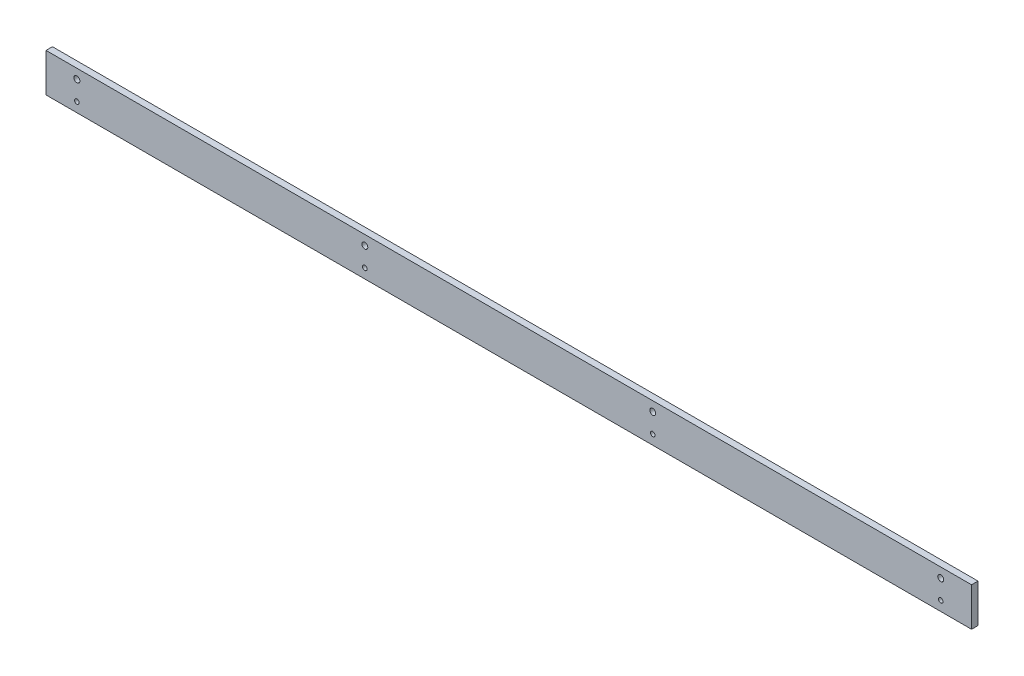
ISO-10303-21;
HEADER;
FILE_DESCRIPTION(('STEP AP214'),'2;1');
FILE_NAME('part.step','',(''),(''),'','','');
FILE_SCHEMA(('AUTOMOTIVE_DESIGN { 1 0 10303 214 1 1 1 1 }'));
ENDSEC;
DATA;
#1=APPLICATION_CONTEXT('core data for automotive mechanical design processes');
#2=APPLICATION_PROTOCOL_DEFINITION('international standard','automotive_design',2000,#1);
#3=PRODUCT_CONTEXT('',#1,'mechanical');
#4=PRODUCT('Part','Part','',(#3));
#5=PRODUCT_RELATED_PRODUCT_CATEGORY('part','',(#4));
#6=PRODUCT_DEFINITION_FORMATION('','',#4);
#7=PRODUCT_DEFINITION_CONTEXT('part definition',#1,'design');
#8=PRODUCT_DEFINITION('design','',#6,#7);
#9=PRODUCT_DEFINITION_SHAPE('','',#8);
#10=(LENGTH_UNIT() NAMED_UNIT(*) SI_UNIT(.MILLI.,.METRE.));
#11=(NAMED_UNIT(*) PLANE_ANGLE_UNIT() SI_UNIT($,.RADIAN.));
#12=(NAMED_UNIT(*) SI_UNIT($,.STERADIAN.) SOLID_ANGLE_UNIT());
#13=UNCERTAINTY_MEASURE_WITH_UNIT(LENGTH_MEASURE(1.E-05),#10,'distance_accuracy_value','');
#14=(GEOMETRIC_REPRESENTATION_CONTEXT(3) GLOBAL_UNCERTAINTY_ASSIGNED_CONTEXT((#13)) GLOBAL_UNIT_ASSIGNED_CONTEXT((#10,
#11,#12)) REPRESENTATION_CONTEXT('',''));
#15=CARTESIAN_POINT('',(0.,0.,0.));
#16=DIRECTION('',(0.,0.,1.));
#17=DIRECTION('',(1.,0.,0.));
#18=AXIS2_PLACEMENT_3D('',#15,#16,#17);
#19=CARTESIAN_POINT('',(-228.6,9.525,3.175));
#20=DIRECTION('',(1.,0.,0.));
#21=DIRECTION('',(0.,0.,-1.));
#22=AXIS2_PLACEMENT_3D('',#19,#20,#21);
#23=PLANE('',#22);
#24=DIRECTION('',(0.,-1.,0.));
#25=VECTOR('',#24,1.);
#26=CARTESIAN_POINT('',(-228.6,9.525,0.));
#27=LINE('',#26,#25);
#28=CARTESIAN_POINT('',(-228.6,9.525,0.));
#29=VERTEX_POINT('',#28);
#30=CARTESIAN_POINT('',(-228.6,-9.525,0.));
#31=VERTEX_POINT('',#30);
#32=EDGE_CURVE('E110',#29,#31,#27,.T.);
#33=ORIENTED_EDGE('',*,*,#32,.T.);
#34=DIRECTION('',(0.,0.,-1.));
#35=VECTOR('',#34,1.);
#36=CARTESIAN_POINT('',(-228.6,-9.525,3.175));
#37=LINE('',#36,#35);
#38=CARTESIAN_POINT('',(-228.6,-9.525,3.175));
#39=VERTEX_POINT('',#38);
#40=EDGE_CURVE('E13',#39,#31,#37,.T.);
#41=ORIENTED_EDGE('',*,*,#40,.F.);
#42=DIRECTION('',(0.,-1.,0.));
#43=VECTOR('',#42,1.);
#44=CARTESIAN_POINT('',(-228.6,9.525,3.175));
#45=LINE('',#44,#43);
#46=CARTESIAN_POINT('',(-228.6,9.525,3.175));
#47=VERTEX_POINT('',#46);
#48=EDGE_CURVE('E98',#47,#39,#45,.T.);
#49=ORIENTED_EDGE('',*,*,#48,.F.);
#50=DIRECTION('',(0.,0.,-1.));
#51=VECTOR('',#50,1.);
#52=CARTESIAN_POINT('',(-228.6,9.525,3.175));
#53=LINE('',#52,#51);
#54=EDGE_CURVE('E106',#47,#29,#53,.T.);
#55=ORIENTED_EDGE('',*,*,#54,.T.);
#56=EDGE_LOOP('',(#33,#41,#49,#55));
#57=FACE_BOUND('',#56,.T.);
#58=ADVANCED_FACE('F47',(#57),#23,.F.);
#59=CARTESIAN_POINT('',(228.6,-9.525,3.175));
#60=DIRECTION('',(0.,1.,0.));
#61=DIRECTION('',(0.,0.,1.));
#62=AXIS2_PLACEMENT_3D('',#59,#60,#61);
#63=PLANE('',#62);
#64=DIRECTION('',(1.,0.,0.));
#65=VECTOR('',#64,1.);
#66=CARTESIAN_POINT('',(228.6,-9.525,0.));
#67=LINE('',#66,#65);
#68=CARTESIAN_POINT('',(228.6,-9.525,0.));
#69=VERTEX_POINT('',#68);
#70=EDGE_CURVE('E102',#31,#69,#67,.T.);
#71=ORIENTED_EDGE('',*,*,#70,.T.);
#72=DIRECTION('',(0.,0.,-1.));
#73=VECTOR('',#72,1.);
#74=CARTESIAN_POINT('',(228.6,-9.525,3.175));
#75=LINE('',#74,#73);
#76=CARTESIAN_POINT('',(228.6,-9.525,3.175));
#77=VERTEX_POINT('',#76);
#78=EDGE_CURVE('E55',#77,#69,#75,.T.);
#79=ORIENTED_EDGE('',*,*,#78,.F.);
#80=DIRECTION('',(1.,0.,0.));
#81=VECTOR('',#80,1.);
#82=CARTESIAN_POINT('',(228.6,-9.525,3.175));
#83=LINE('',#82,#81);
#84=EDGE_CURVE('E93',#39,#77,#83,.T.);
#85=ORIENTED_EDGE('',*,*,#84,.F.);
#86=ORIENTED_EDGE('',*,*,#40,.T.);
#87=EDGE_LOOP('',(#71,#79,#85,#86));
#88=FACE_BOUND('',#87,.T.);
#89=ADVANCED_FACE('F101',(#88),#63,.F.);
#90=CARTESIAN_POINT('',(228.6,9.525,3.175));
#91=DIRECTION('',(-1.,0.,0.));
#92=DIRECTION('',(0.,0.,1.));
#93=AXIS2_PLACEMENT_3D('',#90,#91,#92);
#94=PLANE('',#93);
#95=DIRECTION('',(0.,1.,0.));
#96=VECTOR('',#95,1.);
#97=CARTESIAN_POINT('',(228.6,9.525,0.));
#98=LINE('',#97,#96);
#99=CARTESIAN_POINT('',(228.6,9.525,0.));
#100=VERTEX_POINT('',#99);
#101=EDGE_CURVE('E80',#69,#100,#98,.T.);
#102=ORIENTED_EDGE('',*,*,#101,.T.);
#103=DIRECTION('',(0.,0.,-1.));
#104=VECTOR('',#103,1.);
#105=CARTESIAN_POINT('',(228.6,9.525,3.175));
#106=LINE('',#105,#104);
#107=CARTESIAN_POINT('',(228.6,9.525,3.175));
#108=VERTEX_POINT('',#107);
#109=EDGE_CURVE('E103',#108,#100,#106,.T.);
#110=ORIENTED_EDGE('',*,*,#109,.F.);
#111=DIRECTION('',(0.,1.,0.));
#112=VECTOR('',#111,1.);
#113=CARTESIAN_POINT('',(228.6,9.525,3.175));
#114=LINE('',#113,#112);
#115=EDGE_CURVE('E96',#77,#108,#114,.T.);
#116=ORIENTED_EDGE('',*,*,#115,.F.);
#117=ORIENTED_EDGE('',*,*,#78,.T.);
#118=EDGE_LOOP('',(#102,#110,#116,#117));
#119=FACE_BOUND('',#118,.T.);
#120=ADVANCED_FACE('F104',(#119),#94,.F.);
#121=CARTESIAN_POINT('',(228.6,9.525,3.175));
#122=DIRECTION('',(0.,-1.,0.));
#123=DIRECTION('',(0.,0.,-1.));
#124=AXIS2_PLACEMENT_3D('',#121,#122,#123);
#125=PLANE('',#124);
#126=DIRECTION('',(-1.,0.,0.));
#127=VECTOR('',#126,1.);
#128=CARTESIAN_POINT('',(228.6,9.525,0.));
#129=LINE('',#128,#127);
#130=EDGE_CURVE('E86',#100,#29,#129,.T.);
#131=ORIENTED_EDGE('',*,*,#130,.T.);
#132=ORIENTED_EDGE('',*,*,#54,.F.);
#133=DIRECTION('',(-1.,0.,0.));
#134=VECTOR('',#133,1.);
#135=CARTESIAN_POINT('',(228.6,9.525,3.175));
#136=LINE('',#135,#134);
#137=EDGE_CURVE('E63',#108,#47,#136,.T.);
#138=ORIENTED_EDGE('',*,*,#137,.F.);
#139=ORIENTED_EDGE('',*,*,#109,.T.);
#140=EDGE_LOOP('',(#131,#132,#138,#139));
#141=FACE_BOUND('',#140,.T.);
#142=ADVANCED_FACE('F118',(#141),#125,.F.);
#143=CARTESIAN_POINT('',(0.,0.,3.175));
#144=DIRECTION('',(0.,0.,-1.));
#145=DIRECTION('',(-1.,0.,0.));
#146=AXIS2_PLACEMENT_3D('',#143,#144,#145);
#147=PLANE('',#146);
#148=CARTESIAN_POINT('',(-213.36,-4.7625,3.175));
#149=DIRECTION('',(0.,0.,1.));
#150=DIRECTION('',(1.,0.,0.));
#151=AXIS2_PLACEMENT_3D('',#148,#149,#150);
#152=CIRCLE('',#151,1.1303);
#153=CARTESIAN_POINT('',(-212.2297,-4.7625,3.175));
#154=VERTEX_POINT('',#153);
#155=EDGE_CURVE('E168',#154,#154,#152,.T.);
#156=ORIENTED_EDGE('',*,*,#155,.F.);
#157=EDGE_LOOP('',(#156));
#158=FACE_BOUND('',#157,.T.);
#159=CARTESIAN_POINT('',(-71.12,-4.7625,3.175));
#160=DIRECTION('',(0.,0.,1.));
#161=DIRECTION('',(1.,0.,0.));
#162=AXIS2_PLACEMENT_3D('',#159,#160,#161);
#163=CIRCLE('',#162,1.1303);
#164=CARTESIAN_POINT('',(-69.9897,-4.7625,3.175));
#165=VERTEX_POINT('',#164);
#166=EDGE_CURVE('E162',#165,#165,#163,.T.);
#167=ORIENTED_EDGE('',*,*,#166,.F.);
#168=EDGE_LOOP('',(#167));
#169=FACE_BOUND('',#168,.T.);
#170=CARTESIAN_POINT('',(71.12,-4.7625,3.175));
#171=DIRECTION('',(0.,0.,1.));
#172=DIRECTION('',(1.,0.,0.));
#173=AXIS2_PLACEMENT_3D('',#170,#171,#172);
#174=CIRCLE('',#173,1.1303);
#175=CARTESIAN_POINT('',(72.2503,-4.7625,3.175));
#176=VERTEX_POINT('',#175);
#177=EDGE_CURVE('E156',#176,#176,#174,.T.);
#178=ORIENTED_EDGE('',*,*,#177,.F.);
#179=EDGE_LOOP('',(#178));
#180=FACE_BOUND('',#179,.T.);
#181=CARTESIAN_POINT('',(213.36,-4.7625,3.175));
#182=DIRECTION('',(0.,0.,1.));
#183=DIRECTION('',(1.,0.,0.));
#184=AXIS2_PLACEMENT_3D('',#181,#182,#183);
#185=CIRCLE('',#184,1.1303);
#186=CARTESIAN_POINT('',(214.4903,-4.7625,3.175));
#187=VERTEX_POINT('',#186);
#188=EDGE_CURVE('E150',#187,#187,#185,.T.);
#189=ORIENTED_EDGE('',*,*,#188,.F.);
#190=EDGE_LOOP('',(#189));
#191=FACE_BOUND('',#190,.T.);
#192=CARTESIAN_POINT('',(-213.36,4.7625,3.175));
#193=DIRECTION('',(0.,0.,1.));
#194=DIRECTION('',(1.,0.,0.));
#195=AXIS2_PLACEMENT_3D('',#192,#193,#194);
#196=CIRCLE('',#195,1.47319999999998);
#197=CARTESIAN_POINT('',(-211.8868,4.7625,3.175));
#198=VERTEX_POINT('',#197);
#199=EDGE_CURVE('E144',#198,#198,#196,.T.);
#200=ORIENTED_EDGE('',*,*,#199,.F.);
#201=EDGE_LOOP('',(#200));
#202=FACE_BOUND('',#201,.T.);
#203=CARTESIAN_POINT('',(-71.12,4.76249999999993,3.175));
#204=DIRECTION('',(0.,0.,1.));
#205=DIRECTION('',(1.,0.,0.));
#206=AXIS2_PLACEMENT_3D('',#203,#204,#205);
#207=CIRCLE('',#206,1.47319999999998);
#208=CARTESIAN_POINT('',(-69.6468,4.76249999999993,3.175));
#209=VERTEX_POINT('',#208);
#210=EDGE_CURVE('E138',#209,#209,#207,.T.);
#211=ORIENTED_EDGE('',*,*,#210,.F.);
#212=EDGE_LOOP('',(#211));
#213=FACE_BOUND('',#212,.T.);
#214=CARTESIAN_POINT('',(71.12,4.76249999999997,3.175));
#215=DIRECTION('',(0.,0.,1.));
#216=DIRECTION('',(1.,0.,0.));
#217=AXIS2_PLACEMENT_3D('',#214,#215,#216);
#218=CIRCLE('',#217,1.47319999999998);
#219=CARTESIAN_POINT('',(72.5932,4.76249999999997,3.175));
#220=VERTEX_POINT('',#219);
#221=EDGE_CURVE('E132',#220,#220,#218,.T.);
#222=ORIENTED_EDGE('',*,*,#221,.F.);
#223=EDGE_LOOP('',(#222));
#224=FACE_BOUND('',#223,.T.);
#225=CARTESIAN_POINT('',(213.36,4.7625,3.175));
#226=DIRECTION('',(0.,0.,1.));
#227=DIRECTION('',(1.,0.,0.));
#228=AXIS2_PLACEMENT_3D('',#225,#226,#227);
#229=CIRCLE('',#228,1.47319999999998);
#230=CARTESIAN_POINT('',(214.8332,4.7625,3.175));
#231=VERTEX_POINT('',#230);
#232=EDGE_CURVE('E126',#231,#231,#229,.T.);
#233=ORIENTED_EDGE('',*,*,#232,.F.);
#234=EDGE_LOOP('',(#233));
#235=FACE_BOUND('',#234,.T.);
#236=ORIENTED_EDGE('',*,*,#48,.T.);
#237=ORIENTED_EDGE('',*,*,#84,.T.);
#238=ORIENTED_EDGE('',*,*,#115,.T.);
#239=ORIENTED_EDGE('',*,*,#137,.T.);
#240=EDGE_LOOP('',(#236,#237,#238,#239));
#241=FACE_BOUND('',#240,.T.);
#242=ADVANCED_FACE('F94',(#158,#169,#180,#191,#202,#213,#224,#235,#241),#147,.F.);
#243=CARTESIAN_POINT('',(0.,0.,0.));
#244=DIRECTION('',(0.,0.,-1.));
#245=DIRECTION('',(-1.,0.,0.));
#246=AXIS2_PLACEMENT_3D('',#243,#244,#245);
#247=PLANE('',#246);
#248=CARTESIAN_POINT('',(-213.36,-4.7625,0.));
#249=DIRECTION('',(0.,0.,1.));
#250=DIRECTION('',(1.,0.,0.));
#251=AXIS2_PLACEMENT_3D('',#248,#249,#250);
#252=CIRCLE('',#251,1.1303);
#253=CARTESIAN_POINT('',(-212.2297,-4.7625,0.));
#254=VERTEX_POINT('',#253);
#255=EDGE_CURVE('E165',#254,#254,#252,.T.);
#256=ORIENTED_EDGE('',*,*,#255,.T.);
#257=EDGE_LOOP('',(#256));
#258=FACE_BOUND('',#257,.T.);
#259=CARTESIAN_POINT('',(-71.12,-4.7625,0.));
#260=DIRECTION('',(0.,0.,1.));
#261=DIRECTION('',(1.,0.,0.));
#262=AXIS2_PLACEMENT_3D('',#259,#260,#261);
#263=CIRCLE('',#262,1.1303);
#264=CARTESIAN_POINT('',(-69.9897,-4.7625,0.));
#265=VERTEX_POINT('',#264);
#266=EDGE_CURVE('E159',#265,#265,#263,.T.);
#267=ORIENTED_EDGE('',*,*,#266,.T.);
#268=EDGE_LOOP('',(#267));
#269=FACE_BOUND('',#268,.T.);
#270=CARTESIAN_POINT('',(71.12,-4.7625,0.));
#271=DIRECTION('',(0.,0.,1.));
#272=DIRECTION('',(1.,0.,0.));
#273=AXIS2_PLACEMENT_3D('',#270,#271,#272);
#274=CIRCLE('',#273,1.1303);
#275=CARTESIAN_POINT('',(72.2503,-4.7625,0.));
#276=VERTEX_POINT('',#275);
#277=EDGE_CURVE('E153',#276,#276,#274,.T.);
#278=ORIENTED_EDGE('',*,*,#277,.T.);
#279=EDGE_LOOP('',(#278));
#280=FACE_BOUND('',#279,.T.);
#281=CARTESIAN_POINT('',(213.36,-4.7625,0.));
#282=DIRECTION('',(0.,0.,1.));
#283=DIRECTION('',(1.,0.,0.));
#284=AXIS2_PLACEMENT_3D('',#281,#282,#283);
#285=CIRCLE('',#284,1.1303);
#286=CARTESIAN_POINT('',(214.4903,-4.7625,0.));
#287=VERTEX_POINT('',#286);
#288=EDGE_CURVE('E147',#287,#287,#285,.T.);
#289=ORIENTED_EDGE('',*,*,#288,.T.);
#290=EDGE_LOOP('',(#289));
#291=FACE_BOUND('',#290,.T.);
#292=CARTESIAN_POINT('',(-213.36,4.7625,0.));
#293=DIRECTION('',(0.,0.,1.));
#294=DIRECTION('',(1.,0.,0.));
#295=AXIS2_PLACEMENT_3D('',#292,#293,#294);
#296=CIRCLE('',#295,1.47320000000001);
#297=CARTESIAN_POINT('',(-211.8868,4.7625,0.));
#298=VERTEX_POINT('',#297);
#299=EDGE_CURVE('E141',#298,#298,#296,.T.);
#300=ORIENTED_EDGE('',*,*,#299,.T.);
#301=EDGE_LOOP('',(#300));
#302=FACE_BOUND('',#301,.T.);
#303=CARTESIAN_POINT('',(-71.12,4.76249999999993,0.));
#304=DIRECTION('',(0.,0.,1.));
#305=DIRECTION('',(1.,0.,0.));
#306=AXIS2_PLACEMENT_3D('',#303,#304,#305);
#307=CIRCLE('',#306,1.47319999999999);
#308=CARTESIAN_POINT('',(-69.6468,4.76249999999993,0.));
#309=VERTEX_POINT('',#308);
#310=EDGE_CURVE('E135',#309,#309,#307,.T.);
#311=ORIENTED_EDGE('',*,*,#310,.T.);
#312=EDGE_LOOP('',(#311));
#313=FACE_BOUND('',#312,.T.);
#314=CARTESIAN_POINT('',(71.12,4.76249999999997,0.));
#315=DIRECTION('',(0.,0.,1.));
#316=DIRECTION('',(1.,0.,0.));
#317=AXIS2_PLACEMENT_3D('',#314,#315,#316);
#318=CIRCLE('',#317,1.47319999999999);
#319=CARTESIAN_POINT('',(72.5932,4.76249999999997,0.));
#320=VERTEX_POINT('',#319);
#321=EDGE_CURVE('E129',#320,#320,#318,.T.);
#322=ORIENTED_EDGE('',*,*,#321,.T.);
#323=EDGE_LOOP('',(#322));
#324=FACE_BOUND('',#323,.T.);
#325=CARTESIAN_POINT('',(213.36,4.7625,0.));
#326=DIRECTION('',(0.,0.,1.));
#327=DIRECTION('',(1.,0.,0.));
#328=AXIS2_PLACEMENT_3D('',#325,#326,#327);
#329=CIRCLE('',#328,1.47320000000001);
#330=CARTESIAN_POINT('',(214.8332,4.7625,0.));
#331=VERTEX_POINT('',#330);
#332=EDGE_CURVE('E113',#331,#331,#329,.T.);
#333=ORIENTED_EDGE('',*,*,#332,.T.);
#334=EDGE_LOOP('',(#333));
#335=FACE_BOUND('',#334,.T.);
#336=ORIENTED_EDGE('',*,*,#32,.F.);
#337=ORIENTED_EDGE('',*,*,#130,.F.);
#338=ORIENTED_EDGE('',*,*,#101,.F.);
#339=ORIENTED_EDGE('',*,*,#70,.F.);
#340=EDGE_LOOP('',(#336,#337,#338,#339));
#341=FACE_BOUND('',#340,.T.);
#342=ADVANCED_FACE('F121',(#258,#269,#280,#291,#302,#313,#324,#335,#341),#247,.T.);
#343=CARTESIAN_POINT('',(213.36,4.7625,3.175));
#344=DIRECTION('',(0.,0.,1.));
#345=DIRECTION('',(1.,0.,0.));
#346=AXIS2_PLACEMENT_3D('',#343,#344,#345);
#347=CYLINDRICAL_SURFACE('',#346,1.47319999999999);
#348=ORIENTED_EDGE('',*,*,#332,.F.);
#349=EDGE_LOOP('',(#348));
#350=FACE_BOUND('',#349,.T.);
#351=ORIENTED_EDGE('',*,*,#232,.T.);
#352=EDGE_LOOP('',(#351));
#353=FACE_BOUND('',#352,.T.);
#354=ADVANCED_FACE('F191',(#350,#353),#347,.F.);
#355=CARTESIAN_POINT('',(71.12,4.76249999999997,3.175));
#356=DIRECTION('',(0.,0.,1.));
#357=DIRECTION('',(1.,0.,0.));
#358=AXIS2_PLACEMENT_3D('',#355,#356,#357);
#359=CYLINDRICAL_SURFACE('',#358,1.47319999999999);
#360=ORIENTED_EDGE('',*,*,#321,.F.);
#361=EDGE_LOOP('',(#360));
#362=FACE_BOUND('',#361,.T.);
#363=ORIENTED_EDGE('',*,*,#221,.T.);
#364=EDGE_LOOP('',(#363));
#365=FACE_BOUND('',#364,.T.);
#366=ADVANCED_FACE('F193',(#362,#365),#359,.F.);
#367=CARTESIAN_POINT('',(-71.12,4.76249999999993,3.175));
#368=DIRECTION('',(0.,0.,1.));
#369=DIRECTION('',(1.,0.,0.));
#370=AXIS2_PLACEMENT_3D('',#367,#368,#369);
#371=CYLINDRICAL_SURFACE('',#370,1.47319999999999);
#372=ORIENTED_EDGE('',*,*,#310,.F.);
#373=EDGE_LOOP('',(#372));
#374=FACE_BOUND('',#373,.T.);
#375=ORIENTED_EDGE('',*,*,#210,.T.);
#376=EDGE_LOOP('',(#375));
#377=FACE_BOUND('',#376,.T.);
#378=ADVANCED_FACE('F200',(#374,#377),#371,.F.);
#379=CARTESIAN_POINT('',(-213.36,4.7625,3.175));
#380=DIRECTION('',(0.,0.,1.));
#381=DIRECTION('',(1.,0.,0.));
#382=AXIS2_PLACEMENT_3D('',#379,#380,#381);
#383=CYLINDRICAL_SURFACE('',#382,1.47319999999999);
#384=ORIENTED_EDGE('',*,*,#299,.F.);
#385=EDGE_LOOP('',(#384));
#386=FACE_BOUND('',#385,.T.);
#387=ORIENTED_EDGE('',*,*,#199,.T.);
#388=EDGE_LOOP('',(#387));
#389=FACE_BOUND('',#388,.T.);
#390=ADVANCED_FACE('F242',(#386,#389),#383,.F.);
#391=CARTESIAN_POINT('',(213.36,-4.7625,3.175));
#392=DIRECTION('',(0.,0.,1.));
#393=DIRECTION('',(1.,0.,0.));
#394=AXIS2_PLACEMENT_3D('',#391,#392,#393);
#395=CYLINDRICAL_SURFACE('',#394,1.1303);
#396=ORIENTED_EDGE('',*,*,#288,.F.);
#397=EDGE_LOOP('',(#396));
#398=FACE_BOUND('',#397,.T.);
#399=ORIENTED_EDGE('',*,*,#188,.T.);
#400=EDGE_LOOP('',(#399));
#401=FACE_BOUND('',#400,.T.);
#402=ADVANCED_FACE('F235',(#398,#401),#395,.F.);
#403=CARTESIAN_POINT('',(71.12,-4.7625,3.175));
#404=DIRECTION('',(0.,0.,1.));
#405=DIRECTION('',(1.,0.,0.));
#406=AXIS2_PLACEMENT_3D('',#403,#404,#405);
#407=CYLINDRICAL_SURFACE('',#406,1.1303);
#408=ORIENTED_EDGE('',*,*,#277,.F.);
#409=EDGE_LOOP('',(#408));
#410=FACE_BOUND('',#409,.T.);
#411=ORIENTED_EDGE('',*,*,#177,.T.);
#412=EDGE_LOOP('',(#411));
#413=FACE_BOUND('',#412,.T.);
#414=ADVANCED_FACE('F241',(#410,#413),#407,.F.);
#415=CARTESIAN_POINT('',(-71.12,-4.7625,3.175));
#416=DIRECTION('',(0.,0.,1.));
#417=DIRECTION('',(1.,0.,0.));
#418=AXIS2_PLACEMENT_3D('',#415,#416,#417);
#419=CYLINDRICAL_SURFACE('',#418,1.1303);
#420=ORIENTED_EDGE('',*,*,#266,.F.);
#421=EDGE_LOOP('',(#420));
#422=FACE_BOUND('',#421,.T.);
#423=ORIENTED_EDGE('',*,*,#166,.T.);
#424=EDGE_LOOP('',(#423));
#425=FACE_BOUND('',#424,.T.);
#426=ADVANCED_FACE('F254',(#422,#425),#419,.F.);
#427=CARTESIAN_POINT('',(-213.36,-4.7625,3.175));
#428=DIRECTION('',(0.,0.,1.));
#429=DIRECTION('',(1.,0.,0.));
#430=AXIS2_PLACEMENT_3D('',#427,#428,#429);
#431=CYLINDRICAL_SURFACE('',#430,1.1303);
#432=ORIENTED_EDGE('',*,*,#255,.F.);
#433=EDGE_LOOP('',(#432));
#434=FACE_BOUND('',#433,.T.);
#435=ORIENTED_EDGE('',*,*,#155,.T.);
#436=EDGE_LOOP('',(#435));
#437=FACE_BOUND('',#436,.T.);
#438=ADVANCED_FACE('F172',(#434,#437),#431,.F.);
#439=CLOSED_SHELL('',(#58,#89,#120,#142,#242,#342,#354,#366,#378,#390,#402,#414,#426,#438));
#440=MANIFOLD_SOLID_BREP('B2',#439);
#441=ADVANCED_BREP_SHAPE_REPRESENTATION('',(#18,#440),#14);
#442=SHAPE_DEFINITION_REPRESENTATION(#9,#441);
ENDSEC;
END-ISO-10303-21;
